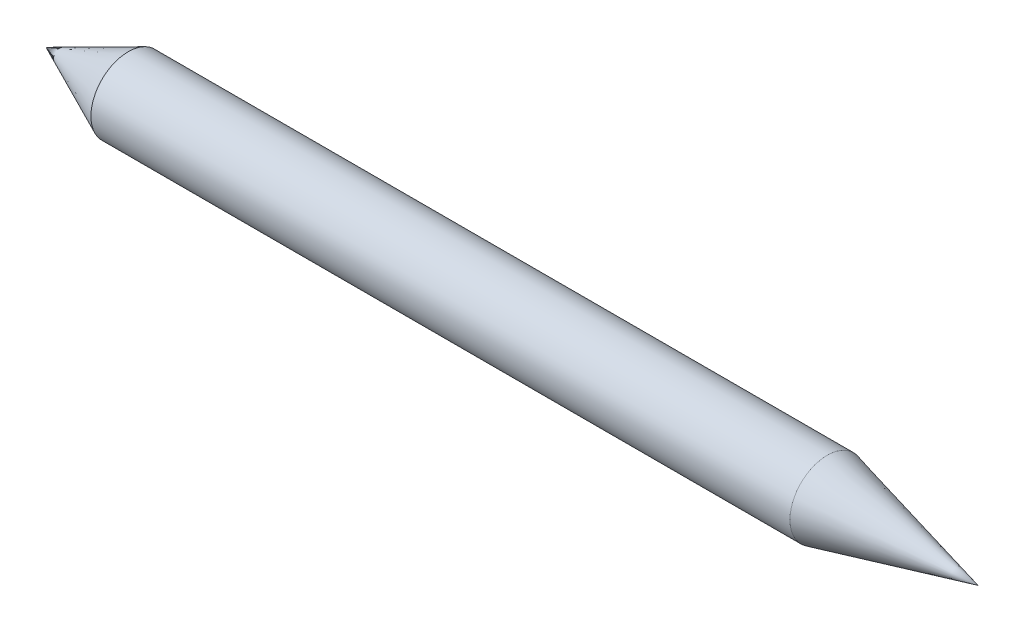
ISO-10303-21;
HEADER;
FILE_DESCRIPTION(('STEP AP214'),'2;1');
FILE_NAME('part.step','',(''),(''),'','','');
FILE_SCHEMA(('AUTOMOTIVE_DESIGN { 1 0 10303 214 1 1 1 1 }'));
ENDSEC;
DATA;
#1=APPLICATION_CONTEXT('core data for automotive mechanical design processes');
#2=APPLICATION_PROTOCOL_DEFINITION('international standard','automotive_design',2000,#1);
#3=PRODUCT_CONTEXT('',#1,'mechanical');
#4=PRODUCT('Part','Part','',(#3));
#5=PRODUCT_RELATED_PRODUCT_CATEGORY('part','',(#4));
#6=PRODUCT_DEFINITION_FORMATION('','',#4);
#7=PRODUCT_DEFINITION_CONTEXT('part definition',#1,'design');
#8=PRODUCT_DEFINITION('design','',#6,#7);
#9=PRODUCT_DEFINITION_SHAPE('','',#8);
#10=(LENGTH_UNIT() NAMED_UNIT(*) SI_UNIT(.MILLI.,.METRE.));
#11=(NAMED_UNIT(*) PLANE_ANGLE_UNIT() SI_UNIT($,.RADIAN.));
#12=(NAMED_UNIT(*) SI_UNIT($,.STERADIAN.) SOLID_ANGLE_UNIT());
#13=UNCERTAINTY_MEASURE_WITH_UNIT(LENGTH_MEASURE(1.E-05),#10,'distance_accuracy_value','');
#14=(GEOMETRIC_REPRESENTATION_CONTEXT(3) GLOBAL_UNCERTAINTY_ASSIGNED_CONTEXT((#13)) GLOBAL_UNIT_ASSIGNED_CONTEXT((#10,
#11,#12)) REPRESENTATION_CONTEXT('',''));
#15=CARTESIAN_POINT('',(0.,0.,0.));
#16=DIRECTION('',(0.,0.,1.));
#17=DIRECTION('',(1.,0.,0.));
#18=AXIS2_PLACEMENT_3D('',#15,#16,#17);
#19=CARTESIAN_POINT('',(-61.4092595220045,7.18483976992605,0.));
#20=DIRECTION('',(1.,0.,0.));
#21=DIRECTION('',(0.,0.,-1.));
#22=AXIS2_PLACEMENT_3D('',#19,#20,#21);
#23=CONICAL_SURFACE('',#22,7.99999999999998,0.425689930779937);
#24=CARTESIAN_POINT('',(-79.0531529840006,7.18483976992605,0.));
#25=VERTEX_POINT('',#24);
#26=VERTEX_LOOP('',#25);
#27=FACE_BOUND('',#26,.T.);
#28=CARTESIAN_POINT('',(-61.4092595220045,7.18483976992605,0.));
#29=DIRECTION('',(-1.,0.,0.));
#30=DIRECTION('',(0.,0.,1.));
#31=AXIS2_PLACEMENT_3D('',#28,#29,#30);
#32=CIRCLE('',#31,7.99999999999998);
#33=CARTESIAN_POINT('',(-61.4092595220045,7.18483976992605,7.99999999999998));
#34=VERTEX_POINT('',#33);
#35=EDGE_CURVE('E11',#34,#34,#32,.T.);
#36=ORIENTED_EDGE('',*,*,#35,.T.);
#37=EDGE_LOOP('',(#36));
#38=FACE_BOUND('',#37,.T.);
#39=ADVANCED_FACE('F35',(#27,#38),#23,.T.);
#40=CARTESIAN_POINT('',(-79.0531529840006,7.18483976992605,0.));
#41=DIRECTION('',(-1.,0.,0.));
#42=DIRECTION('',(0.,0.,1.));
#43=AXIS2_PLACEMENT_3D('',#40,#41,#42);
#44=CYLINDRICAL_SURFACE('',#43,7.99999999999999);
#45=ORIENTED_EDGE('',*,*,#35,.F.);
#46=EDGE_LOOP('',(#45));
#47=FACE_BOUND('',#46,.T.);
#48=CARTESIAN_POINT('',(88.5907404779955,7.18483976992605,0.));
#49=DIRECTION('',(-1.,0.,0.));
#50=DIRECTION('',(0.,0.,1.));
#51=AXIS2_PLACEMENT_3D('',#48,#49,#50);
#52=CIRCLE('',#51,8.);
#53=CARTESIAN_POINT('',(88.5907404779955,7.18483976992605,8.));
#54=VERTEX_POINT('',#53);
#55=EDGE_CURVE('E42',#54,#54,#52,.T.);
#56=ORIENTED_EDGE('',*,*,#55,.T.);
#57=EDGE_LOOP('',(#56));
#58=FACE_BOUND('',#57,.T.);
#59=ADVANCED_FACE('F50',(#47,#58),#44,.T.);
#60=CARTESIAN_POINT('',(120.946847015999,7.18483976992605,0.));
#61=DIRECTION('',(-1.,0.,0.));
#62=DIRECTION('',(0.,0.,1.));
#63=AXIS2_PLACEMENT_3D('',#60,#61,#62);
#64=CONICAL_SURFACE('',#63,0.,0.242387378950397);
#65=ORIENTED_EDGE('',*,*,#55,.F.);
#66=EDGE_LOOP('',(#65));
#67=FACE_BOUND('',#66,.T.);
#68=CARTESIAN_POINT('',(120.946847015999,7.18483976992605,0.));
#69=VERTEX_POINT('',#68);
#70=VERTEX_LOOP('',#69);
#71=FACE_BOUND('',#70,.T.);
#72=ADVANCED_FACE('F55',(#67,#71),#64,.T.);
#73=CLOSED_SHELL('',(#39,#59,#72));
#74=MANIFOLD_SOLID_BREP('B2',#73);
#75=ADVANCED_BREP_SHAPE_REPRESENTATION('',(#18,#74),#14);
#76=SHAPE_DEFINITION_REPRESENTATION(#9,#75);
ENDSEC;
END-ISO-10303-21;
